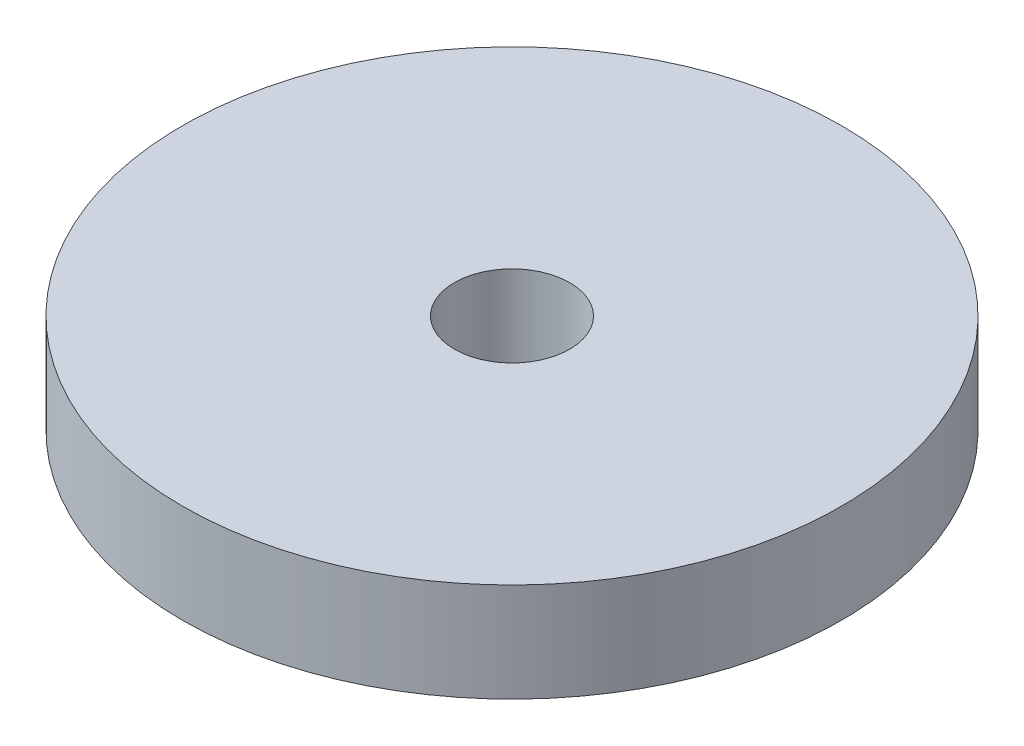
ISO-10303-21;
HEADER;
FILE_DESCRIPTION(('STEP AP214'),'2;1');
FILE_NAME('part.step','',(''),(''),'','','');
FILE_SCHEMA(('AUTOMOTIVE_DESIGN { 1 0 10303 214 1 1 1 1 }'));
ENDSEC;
DATA;
#1=APPLICATION_CONTEXT('core data for automotive mechanical design processes');
#2=APPLICATION_PROTOCOL_DEFINITION('international standard','automotive_design',2000,#1);
#3=PRODUCT_CONTEXT('',#1,'mechanical');
#4=PRODUCT('Part','Part','',(#3));
#5=PRODUCT_RELATED_PRODUCT_CATEGORY('part','',(#4));
#6=PRODUCT_DEFINITION_FORMATION('','',#4);
#7=PRODUCT_DEFINITION_CONTEXT('part definition',#1,'design');
#8=PRODUCT_DEFINITION('design','',#6,#7);
#9=PRODUCT_DEFINITION_SHAPE('','',#8);
#10=(LENGTH_UNIT() NAMED_UNIT(*) SI_UNIT(.MILLI.,.METRE.));
#11=(NAMED_UNIT(*) PLANE_ANGLE_UNIT() SI_UNIT($,.RADIAN.));
#12=(NAMED_UNIT(*) SI_UNIT($,.STERADIAN.) SOLID_ANGLE_UNIT());
#13=UNCERTAINTY_MEASURE_WITH_UNIT(LENGTH_MEASURE(1.E-05),#10,'distance_accuracy_value','');
#14=(GEOMETRIC_REPRESENTATION_CONTEXT(3) GLOBAL_UNCERTAINTY_ASSIGNED_CONTEXT((#13)) GLOBAL_UNIT_ASSIGNED_CONTEXT((#10,
#11,#12)) REPRESENTATION_CONTEXT('',''));
#15=CARTESIAN_POINT('',(0.,0.,0.));
#16=DIRECTION('',(0.,0.,1.));
#17=DIRECTION('',(1.,0.,0.));
#18=AXIS2_PLACEMENT_3D('',#15,#16,#17);
#19=CARTESIAN_POINT('',(0.,6.,0.));
#20=DIRECTION('',(0.,1.,0.));
#21=DIRECTION('',(0.,0.,1.));
#22=AXIS2_PLACEMENT_3D('',#19,#20,#21);
#23=PLANE('',#22);
#24=CARTESIAN_POINT('',(0.,6.,0.));
#25=DIRECTION('',(0.,1.,0.));
#26=DIRECTION('',(0.,0.,1.));
#27=AXIS2_PLACEMENT_3D('',#24,#25,#26);
#28=CIRCLE('',#27,20.);
#29=CARTESIAN_POINT('',(0.,6.,20.));
#30=VERTEX_POINT('',#29);
#31=EDGE_CURVE('E10',#30,#30,#28,.T.);
#32=ORIENTED_EDGE('',*,*,#31,.T.);
#33=EDGE_LOOP('',(#32));
#34=FACE_BOUND('',#33,.T.);
#35=CARTESIAN_POINT('',(0.,6.,0.));
#36=DIRECTION('',(0.,1.,0.));
#37=DIRECTION('',(0.,0.,1.));
#38=AXIS2_PLACEMENT_3D('',#35,#36,#37);
#39=CIRCLE('',#38,3.5);
#40=CARTESIAN_POINT('',(0.,6.,3.5));
#41=VERTEX_POINT('',#40);
#42=EDGE_CURVE('E41',#41,#41,#39,.T.);
#43=ORIENTED_EDGE('',*,*,#42,.F.);
#44=EDGE_LOOP('',(#43));
#45=FACE_BOUND('',#44,.T.);
#46=ADVANCED_FACE('F30',(#34,#45),#23,.T.);
#47=CARTESIAN_POINT('',(0.,0.,0.));
#48=DIRECTION('',(0.,1.,0.));
#49=DIRECTION('',(0.,0.,1.));
#50=AXIS2_PLACEMENT_3D('',#47,#48,#49);
#51=PLANE('',#50);
#52=CARTESIAN_POINT('',(0.,0.,0.));
#53=DIRECTION('',(0.,1.,0.));
#54=DIRECTION('',(0.,0.,1.));
#55=AXIS2_PLACEMENT_3D('',#52,#53,#54);
#56=CIRCLE('',#55,20.);
#57=CARTESIAN_POINT('',(0.,0.,20.));
#58=VERTEX_POINT('',#57);
#59=EDGE_CURVE('E34',#58,#58,#56,.T.);
#60=ORIENTED_EDGE('',*,*,#59,.F.);
#61=EDGE_LOOP('',(#60));
#62=FACE_BOUND('',#61,.T.);
#63=CARTESIAN_POINT('',(0.,0.,0.));
#64=DIRECTION('',(0.,1.,0.));
#65=DIRECTION('',(0.,0.,1.));
#66=AXIS2_PLACEMENT_3D('',#63,#64,#65);
#67=CIRCLE('',#66,3.5);
#68=CARTESIAN_POINT('',(0.,0.,3.5));
#69=VERTEX_POINT('',#68);
#70=EDGE_CURVE('E43',#69,#69,#67,.T.);
#71=ORIENTED_EDGE('',*,*,#70,.T.);
#72=EDGE_LOOP('',(#71));
#73=FACE_BOUND('',#72,.T.);
#74=ADVANCED_FACE('F53',(#62,#73),#51,.F.);
#75=CARTESIAN_POINT('',(0.,6.,0.));
#76=DIRECTION('',(0.,-1.,0.));
#77=DIRECTION('',(0.,0.,-1.));
#78=AXIS2_PLACEMENT_3D('',#75,#76,#77);
#79=CYLINDRICAL_SURFACE('',#78,20.);
#80=ORIENTED_EDGE('',*,*,#31,.F.);
#81=EDGE_LOOP('',(#80));
#82=FACE_BOUND('',#81,.T.);
#83=ORIENTED_EDGE('',*,*,#59,.T.);
#84=EDGE_LOOP('',(#83));
#85=FACE_BOUND('',#84,.T.);
#86=ADVANCED_FACE('F32',(#82,#85),#79,.T.);
#87=CARTESIAN_POINT('',(0.,6.,0.));
#88=DIRECTION('',(0.,-1.,0.));
#89=DIRECTION('',(0.,0.,-1.));
#90=AXIS2_PLACEMENT_3D('',#87,#88,#89);
#91=CYLINDRICAL_SURFACE('',#90,3.5);
#92=ORIENTED_EDGE('',*,*,#42,.T.);
#93=EDGE_LOOP('',(#92));
#94=FACE_BOUND('',#93,.T.);
#95=ORIENTED_EDGE('',*,*,#70,.F.);
#96=EDGE_LOOP('',(#95));
#97=FACE_BOUND('',#96,.T.);
#98=ADVANCED_FACE('F49',(#94,#97),#91,.F.);
#99=CLOSED_SHELL('',(#46,#74,#86,#98));
#100=MANIFOLD_SOLID_BREP('B2',#99);
#101=ADVANCED_BREP_SHAPE_REPRESENTATION('',(#18,#100),#14);
#102=SHAPE_DEFINITION_REPRESENTATION(#9,#101);
ENDSEC;
END-ISO-10303-21;
